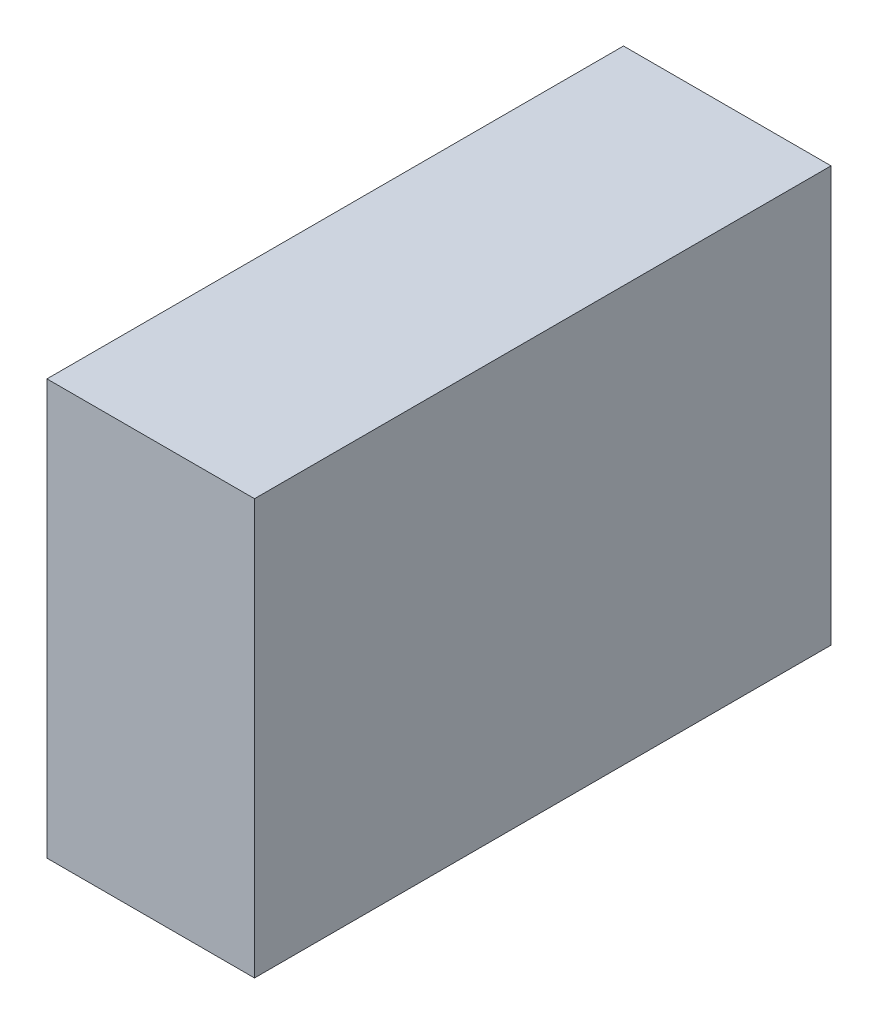
ISO-10303-21;
HEADER;
FILE_DESCRIPTION(('STEP AP214'),'2;1');
FILE_NAME('part.step','',(''),(''),'','','');
FILE_SCHEMA(('AUTOMOTIVE_DESIGN { 1 0 10303 214 1 1 1 1 }'));
ENDSEC;
DATA;
#1=APPLICATION_CONTEXT('core data for automotive mechanical design processes');
#2=APPLICATION_PROTOCOL_DEFINITION('international standard','automotive_design',2000,#1);
#3=PRODUCT_CONTEXT('',#1,'mechanical');
#4=PRODUCT('Part','Part','',(#3));
#5=PRODUCT_RELATED_PRODUCT_CATEGORY('part','',(#4));
#6=PRODUCT_DEFINITION_FORMATION('','',#4);
#7=PRODUCT_DEFINITION_CONTEXT('part definition',#1,'design');
#8=PRODUCT_DEFINITION('design','',#6,#7);
#9=PRODUCT_DEFINITION_SHAPE('','',#8);
#10=(LENGTH_UNIT() NAMED_UNIT(*) SI_UNIT(.MILLI.,.METRE.));
#11=(NAMED_UNIT(*) PLANE_ANGLE_UNIT() SI_UNIT($,.RADIAN.));
#12=(NAMED_UNIT(*) SI_UNIT($,.STERADIAN.) SOLID_ANGLE_UNIT());
#13=UNCERTAINTY_MEASURE_WITH_UNIT(LENGTH_MEASURE(1.E-05),#10,'distance_accuracy_value','');
#14=(GEOMETRIC_REPRESENTATION_CONTEXT(3) GLOBAL_UNCERTAINTY_ASSIGNED_CONTEXT((#13)) GLOBAL_UNIT_ASSIGNED_CONTEXT((#10,
#11,#12)) REPRESENTATION_CONTEXT('',''));
#15=CARTESIAN_POINT('',(0.,0.,0.));
#16=DIRECTION('',(0.,0.,1.));
#17=DIRECTION('',(1.,0.,0.));
#18=AXIS2_PLACEMENT_3D('',#15,#16,#17);
#19=CARTESIAN_POINT('',(0.,0.,50.));
#20=DIRECTION('',(1.,0.,0.));
#21=DIRECTION('',(0.,0.,-1.));
#22=AXIS2_PLACEMENT_3D('',#19,#20,#21);
#23=PLANE('',#22);
#24=DIRECTION('',(0.,-1.,0.));
#25=VECTOR('',#24,1.);
#26=CARTESIAN_POINT('',(0.,0.,0.));
#27=LINE('',#26,#25);
#28=CARTESIAN_POINT('',(0.,36.,0.));
#29=VERTEX_POINT('',#28);
#30=CARTESIAN_POINT('',(0.,0.,0.));
#31=VERTEX_POINT('',#30);
#32=EDGE_CURVE('E100',#29,#31,#27,.T.);
#33=ORIENTED_EDGE('',*,*,#32,.T.);
#34=DIRECTION('',(0.,0.,-1.));
#35=VECTOR('',#34,1.);
#36=CARTESIAN_POINT('',(0.,0.,50.));
#37=LINE('',#36,#35);
#38=CARTESIAN_POINT('',(0.,0.,50.));
#39=VERTEX_POINT('',#38);
#40=EDGE_CURVE('E11',#39,#31,#37,.T.);
#41=ORIENTED_EDGE('',*,*,#40,.F.);
#42=DIRECTION('',(0.,-1.,0.));
#43=VECTOR('',#42,1.);
#44=CARTESIAN_POINT('',(0.,0.,50.));
#45=LINE('',#44,#43);
#46=CARTESIAN_POINT('',(0.,36.,50.));
#47=VERTEX_POINT('',#46);
#48=EDGE_CURVE('E88',#47,#39,#45,.T.);
#49=ORIENTED_EDGE('',*,*,#48,.F.);
#50=DIRECTION('',(0.,0.,-1.));
#51=VECTOR('',#50,1.);
#52=CARTESIAN_POINT('',(0.,36.,50.));
#53=LINE('',#52,#51);
#54=EDGE_CURVE('E96',#47,#29,#53,.T.);
#55=ORIENTED_EDGE('',*,*,#54,.T.);
#56=EDGE_LOOP('',(#33,#41,#49,#55));
#57=FACE_BOUND('',#56,.T.);
#58=ADVANCED_FACE('F37',(#57),#23,.F.);
#59=CARTESIAN_POINT('',(0.,0.,50.));
#60=DIRECTION('',(0.,1.,0.));
#61=DIRECTION('',(0.,0.,1.));
#62=AXIS2_PLACEMENT_3D('',#59,#60,#61);
#63=PLANE('',#62);
#64=DIRECTION('',(1.,0.,0.));
#65=VECTOR('',#64,1.);
#66=CARTESIAN_POINT('',(0.,0.,0.));
#67=LINE('',#66,#65);
#68=CARTESIAN_POINT('',(18.,0.,0.));
#69=VERTEX_POINT('',#68);
#70=EDGE_CURVE('E92',#31,#69,#67,.T.);
#71=ORIENTED_EDGE('',*,*,#70,.T.);
#72=DIRECTION('',(0.,0.,-1.));
#73=VECTOR('',#72,1.);
#74=CARTESIAN_POINT('',(18.,0.,50.));
#75=LINE('',#74,#73);
#76=CARTESIAN_POINT('',(18.,0.,50.));
#77=VERTEX_POINT('',#76);
#78=EDGE_CURVE('E45',#77,#69,#75,.T.);
#79=ORIENTED_EDGE('',*,*,#78,.F.);
#80=DIRECTION('',(1.,0.,0.));
#81=VECTOR('',#80,1.);
#82=CARTESIAN_POINT('',(0.,0.,50.));
#83=LINE('',#82,#81);
#84=EDGE_CURVE('E83',#39,#77,#83,.T.);
#85=ORIENTED_EDGE('',*,*,#84,.F.);
#86=ORIENTED_EDGE('',*,*,#40,.T.);
#87=EDGE_LOOP('',(#71,#79,#85,#86));
#88=FACE_BOUND('',#87,.T.);
#89=ADVANCED_FACE('F91',(#88),#63,.F.);
#90=CARTESIAN_POINT('',(18.,0.,50.));
#91=DIRECTION('',(-1.,0.,0.));
#92=DIRECTION('',(0.,0.,1.));
#93=AXIS2_PLACEMENT_3D('',#90,#91,#92);
#94=PLANE('',#93);
#95=DIRECTION('',(0.,1.,0.));
#96=VECTOR('',#95,1.);
#97=CARTESIAN_POINT('',(18.,0.,0.));
#98=LINE('',#97,#96);
#99=CARTESIAN_POINT('',(18.,36.,0.));
#100=VERTEX_POINT('',#99);
#101=EDGE_CURVE('E70',#69,#100,#98,.T.);
#102=ORIENTED_EDGE('',*,*,#101,.T.);
#103=DIRECTION('',(0.,0.,-1.));
#104=VECTOR('',#103,1.);
#105=CARTESIAN_POINT('',(18.,36.,50.));
#106=LINE('',#105,#104);
#107=CARTESIAN_POINT('',(18.,36.,50.));
#108=VERTEX_POINT('',#107);
#109=EDGE_CURVE('E93',#108,#100,#106,.T.);
#110=ORIENTED_EDGE('',*,*,#109,.F.);
#111=DIRECTION('',(0.,1.,0.));
#112=VECTOR('',#111,1.);
#113=CARTESIAN_POINT('',(18.,0.,50.));
#114=LINE('',#113,#112);
#115=EDGE_CURVE('E86',#77,#108,#114,.T.);
#116=ORIENTED_EDGE('',*,*,#115,.F.);
#117=ORIENTED_EDGE('',*,*,#78,.T.);
#118=EDGE_LOOP('',(#102,#110,#116,#117));
#119=FACE_BOUND('',#118,.T.);
#120=ADVANCED_FACE('F94',(#119),#94,.F.);
#121=CARTESIAN_POINT('',(0.,36.,50.));
#122=DIRECTION('',(0.,-1.,0.));
#123=DIRECTION('',(0.,0.,-1.));
#124=AXIS2_PLACEMENT_3D('',#121,#122,#123);
#125=PLANE('',#124);
#126=DIRECTION('',(-1.,0.,0.));
#127=VECTOR('',#126,1.);
#128=CARTESIAN_POINT('',(0.,36.,0.));
#129=LINE('',#128,#127);
#130=EDGE_CURVE('E76',#100,#29,#129,.T.);
#131=ORIENTED_EDGE('',*,*,#130,.T.);
#132=ORIENTED_EDGE('',*,*,#54,.F.);
#133=DIRECTION('',(-1.,0.,0.));
#134=VECTOR('',#133,1.);
#135=CARTESIAN_POINT('',(0.,36.,50.));
#136=LINE('',#135,#134);
#137=EDGE_CURVE('E53',#108,#47,#136,.T.);
#138=ORIENTED_EDGE('',*,*,#137,.F.);
#139=ORIENTED_EDGE('',*,*,#109,.T.);
#140=EDGE_LOOP('',(#131,#132,#138,#139));
#141=FACE_BOUND('',#140,.T.);
#142=ADVANCED_FACE('F107',(#141),#125,.F.);
#143=CARTESIAN_POINT('',(0.,0.,50.));
#144=DIRECTION('',(0.,0.,-1.));
#145=DIRECTION('',(-1.,0.,0.));
#146=AXIS2_PLACEMENT_3D('',#143,#144,#145);
#147=PLANE('',#146);
#148=ORIENTED_EDGE('',*,*,#48,.T.);
#149=ORIENTED_EDGE('',*,*,#84,.T.);
#150=ORIENTED_EDGE('',*,*,#115,.T.);
#151=ORIENTED_EDGE('',*,*,#137,.T.);
#152=EDGE_LOOP('',(#148,#149,#150,#151));
#153=FACE_BOUND('',#152,.T.);
#154=ADVANCED_FACE('F84',(#153),#147,.F.);
#155=CARTESIAN_POINT('',(0.,0.,0.));
#156=DIRECTION('',(0.,0.,-1.));
#157=DIRECTION('',(-1.,0.,0.));
#158=AXIS2_PLACEMENT_3D('',#155,#156,#157);
#159=PLANE('',#158);
#160=ORIENTED_EDGE('',*,*,#32,.F.);
#161=ORIENTED_EDGE('',*,*,#130,.F.);
#162=ORIENTED_EDGE('',*,*,#101,.F.);
#163=ORIENTED_EDGE('',*,*,#70,.F.);
#164=EDGE_LOOP('',(#160,#161,#162,#163));
#165=FACE_BOUND('',#164,.T.);
#166=ADVANCED_FACE('F110',(#165),#159,.T.);
#167=CLOSED_SHELL('',(#58,#89,#120,#142,#154,#166));
#168=MANIFOLD_SOLID_BREP('B2',#167);
#169=ADVANCED_BREP_SHAPE_REPRESENTATION('',(#18,#168),#14);
#170=SHAPE_DEFINITION_REPRESENTATION(#9,#169);
ENDSEC;
END-ISO-10303-21;
